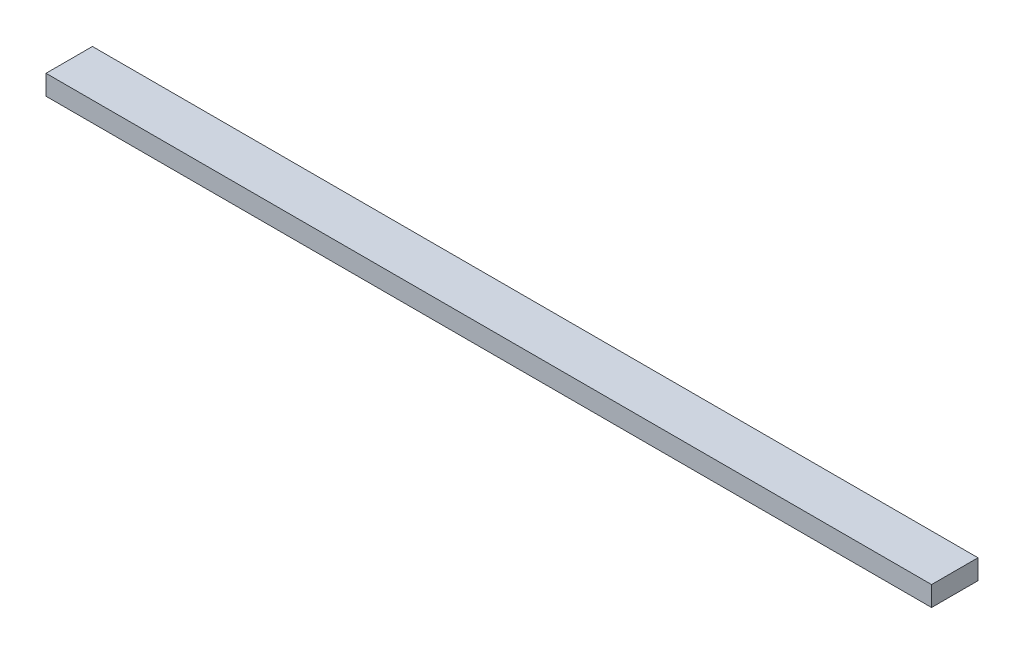
ISO-10303-21;
HEADER;
FILE_DESCRIPTION(('STEP AP214'),'2;1');
FILE_NAME('part.step','',(''),(''),'','','');
FILE_SCHEMA(('AUTOMOTIVE_DESIGN { 1 0 10303 214 1 1 1 1 }'));
ENDSEC;
DATA;
#1=APPLICATION_CONTEXT('core data for automotive mechanical design processes');
#2=APPLICATION_PROTOCOL_DEFINITION('international standard','automotive_design',2000,#1);
#3=PRODUCT_CONTEXT('',#1,'mechanical');
#4=PRODUCT('Part','Part','',(#3));
#5=PRODUCT_RELATED_PRODUCT_CATEGORY('part','',(#4));
#6=PRODUCT_DEFINITION_FORMATION('','',#4);
#7=PRODUCT_DEFINITION_CONTEXT('part definition',#1,'design');
#8=PRODUCT_DEFINITION('design','',#6,#7);
#9=PRODUCT_DEFINITION_SHAPE('','',#8);
#10=(LENGTH_UNIT() NAMED_UNIT(*) SI_UNIT(.MILLI.,.METRE.));
#11=(NAMED_UNIT(*) PLANE_ANGLE_UNIT() SI_UNIT($,.RADIAN.));
#12=(NAMED_UNIT(*) SI_UNIT($,.STERADIAN.) SOLID_ANGLE_UNIT());
#13=UNCERTAINTY_MEASURE_WITH_UNIT(LENGTH_MEASURE(1.E-05),#10,'distance_accuracy_value','');
#14=(GEOMETRIC_REPRESENTATION_CONTEXT(3) GLOBAL_UNCERTAINTY_ASSIGNED_CONTEXT((#13)) GLOBAL_UNIT_ASSIGNED_CONTEXT((#10,
#11,#12)) REPRESENTATION_CONTEXT('',''));
#15=CARTESIAN_POINT('',(0.,0.,0.));
#16=DIRECTION('',(0.,0.,1.));
#17=DIRECTION('',(1.,0.,0.));
#18=AXIS2_PLACEMENT_3D('',#15,#16,#17);
#19=CARTESIAN_POINT('',(0.,38.1,0.));
#20=DIRECTION('',(1.,0.,0.));
#21=DIRECTION('',(0.,0.,-1.));
#22=AXIS2_PLACEMENT_3D('',#19,#20,#21);
#23=PLANE('',#22);
#24=DIRECTION('',(0.,0.,1.));
#25=VECTOR('',#24,1.);
#26=CARTESIAN_POINT('',(0.,0.,0.));
#27=LINE('',#26,#25);
#28=CARTESIAN_POINT('',(0.,0.,-88.9));
#29=VERTEX_POINT('',#28);
#30=CARTESIAN_POINT('',(0.,0.,0.));
#31=VERTEX_POINT('',#30);
#32=EDGE_CURVE('E111',#29,#31,#27,.T.);
#33=ORIENTED_EDGE('',*,*,#32,.T.);
#34=DIRECTION('',(0.,-1.,0.));
#35=VECTOR('',#34,1.);
#36=CARTESIAN_POINT('',(0.,38.1,0.));
#37=LINE('',#36,#35);
#38=CARTESIAN_POINT('',(0.,38.1,0.));
#39=VERTEX_POINT('',#38);
#40=EDGE_CURVE('E11',#39,#31,#37,.T.);
#41=ORIENTED_EDGE('',*,*,#40,.F.);
#42=DIRECTION('',(0.,0.,1.));
#43=VECTOR('',#42,1.);
#44=CARTESIAN_POINT('',(0.,38.1,0.));
#45=LINE('',#44,#43);
#46=CARTESIAN_POINT('',(0.,38.1,-88.9));
#47=VERTEX_POINT('',#46);
#48=EDGE_CURVE('E94',#47,#39,#45,.T.);
#49=ORIENTED_EDGE('',*,*,#48,.F.);
#50=DIRECTION('',(0.,-1.,0.));
#51=VECTOR('',#50,1.);
#52=CARTESIAN_POINT('',(0.,38.1,-88.9));
#53=LINE('',#52,#51);
#54=EDGE_CURVE('E107',#47,#29,#53,.T.);
#55=ORIENTED_EDGE('',*,*,#54,.T.);
#56=EDGE_LOOP('',(#33,#41,#49,#55));
#57=FACE_BOUND('',#56,.T.);
#58=ADVANCED_FACE('F42',(#57),#23,.F.);
#59=CARTESIAN_POINT('',(0.,38.1,0.));
#60=DIRECTION('',(0.,0.,-1.));
#61=DIRECTION('',(-1.,0.,0.));
#62=AXIS2_PLACEMENT_3D('',#59,#60,#61);
#63=PLANE('',#62);
#64=DIRECTION('',(1.,0.,0.));
#65=VECTOR('',#64,1.);
#66=CARTESIAN_POINT('',(0.,0.,0.));
#67=LINE('',#66,#65);
#68=CARTESIAN_POINT('',(1695.45,0.,0.));
#69=VERTEX_POINT('',#68);
#70=EDGE_CURVE('E99',#31,#69,#67,.T.);
#71=ORIENTED_EDGE('',*,*,#70,.T.);
#72=DIRECTION('',(0.,-1.,0.));
#73=VECTOR('',#72,1.);
#74=CARTESIAN_POINT('',(1695.45,38.1,0.));
#75=LINE('',#74,#73);
#76=CARTESIAN_POINT('',(1695.45,38.1,0.));
#77=VERTEX_POINT('',#76);
#78=EDGE_CURVE('E51',#77,#69,#75,.T.);
#79=ORIENTED_EDGE('',*,*,#78,.F.);
#80=DIRECTION('',(1.,0.,0.));
#81=VECTOR('',#80,1.);
#82=CARTESIAN_POINT('',(0.,38.1,0.));
#83=LINE('',#82,#81);
#84=EDGE_CURVE('E89',#39,#77,#83,.T.);
#85=ORIENTED_EDGE('',*,*,#84,.F.);
#86=ORIENTED_EDGE('',*,*,#40,.T.);
#87=EDGE_LOOP('',(#71,#79,#85,#86));
#88=FACE_BOUND('',#87,.T.);
#89=ADVANCED_FACE('F98',(#88),#63,.F.);
#90=CARTESIAN_POINT('',(1695.45,38.1,0.));
#91=DIRECTION('',(-1.,0.,0.));
#92=DIRECTION('',(0.,0.,1.));
#93=AXIS2_PLACEMENT_3D('',#90,#91,#92);
#94=PLANE('',#93);
#95=DIRECTION('',(0.,0.,-1.));
#96=VECTOR('',#95,1.);
#97=CARTESIAN_POINT('',(1695.45,0.,0.));
#98=LINE('',#97,#96);
#99=CARTESIAN_POINT('',(1695.45,0.,-88.9));
#100=VERTEX_POINT('',#99);
#101=EDGE_CURVE('E76',#69,#100,#98,.T.);
#102=ORIENTED_EDGE('',*,*,#101,.T.);
#103=DIRECTION('',(0.,-1.,0.));
#104=VECTOR('',#103,1.);
#105=CARTESIAN_POINT('',(1695.45,38.1,-88.9));
#106=LINE('',#105,#104);
#107=CARTESIAN_POINT('',(1695.45,38.1,-88.9));
#108=VERTEX_POINT('',#107);
#109=EDGE_CURVE('E101',#108,#100,#106,.T.);
#110=ORIENTED_EDGE('',*,*,#109,.F.);
#111=DIRECTION('',(0.,0.,-1.));
#112=VECTOR('',#111,1.);
#113=CARTESIAN_POINT('',(1695.45,38.1,0.));
#114=LINE('',#113,#112);
#115=EDGE_CURVE('E92',#77,#108,#114,.T.);
#116=ORIENTED_EDGE('',*,*,#115,.F.);
#117=ORIENTED_EDGE('',*,*,#78,.T.);
#118=EDGE_LOOP('',(#102,#110,#116,#117));
#119=FACE_BOUND('',#118,.T.);
#120=ADVANCED_FACE('F102',(#119),#94,.F.);
#121=CARTESIAN_POINT('',(0.,38.1,-88.9));
#122=DIRECTION('',(0.,0.,1.));
#123=DIRECTION('',(1.,0.,0.));
#124=AXIS2_PLACEMENT_3D('',#121,#122,#123);
#125=PLANE('',#124);
#126=DIRECTION('',(-1.,0.,0.));
#127=VECTOR('',#126,1.);
#128=CARTESIAN_POINT('',(0.,0.,-88.9));
#129=LINE('',#128,#127);
#130=EDGE_CURVE('E82',#100,#29,#129,.T.);
#131=ORIENTED_EDGE('',*,*,#130,.T.);
#132=ORIENTED_EDGE('',*,*,#54,.F.);
#133=DIRECTION('',(-1.,0.,0.));
#134=VECTOR('',#133,1.);
#135=CARTESIAN_POINT('',(0.,38.1,-88.9));
#136=LINE('',#135,#134);
#137=EDGE_CURVE('E59',#108,#47,#136,.T.);
#138=ORIENTED_EDGE('',*,*,#137,.F.);
#139=ORIENTED_EDGE('',*,*,#109,.T.);
#140=EDGE_LOOP('',(#131,#132,#138,#139));
#141=FACE_BOUND('',#140,.T.);
#142=ADVANCED_FACE('F125',(#141),#125,.F.);
#143=CARTESIAN_POINT('',(0.,38.1,0.));
#144=DIRECTION('',(0.,-1.,0.));
#145=DIRECTION('',(0.,0.,-1.));
#146=AXIS2_PLACEMENT_3D('',#143,#144,#145);
#147=PLANE('',#146);
#148=ORIENTED_EDGE('',*,*,#48,.T.);
#149=ORIENTED_EDGE('',*,*,#84,.T.);
#150=ORIENTED_EDGE('',*,*,#115,.T.);
#151=ORIENTED_EDGE('',*,*,#137,.T.);
#152=EDGE_LOOP('',(#148,#149,#150,#151));
#153=FACE_BOUND('',#152,.T.);
#154=ADVANCED_FACE('F90',(#153),#147,.F.);
#155=CARTESIAN_POINT('',(0.,0.,0.));
#156=DIRECTION('',(0.,-1.,0.));
#157=DIRECTION('',(0.,0.,-1.));
#158=AXIS2_PLACEMENT_3D('',#155,#156,#157);
#159=PLANE('',#158);
#160=ORIENTED_EDGE('',*,*,#32,.F.);
#161=ORIENTED_EDGE('',*,*,#130,.F.);
#162=ORIENTED_EDGE('',*,*,#101,.F.);
#163=ORIENTED_EDGE('',*,*,#70,.F.);
#164=EDGE_LOOP('',(#160,#161,#162,#163));
#165=FACE_BOUND('',#164,.T.);
#166=ADVANCED_FACE('F128',(#165),#159,.T.);
#167=CLOSED_SHELL('',(#58,#89,#120,#142,#154,#166));
#168=MANIFOLD_SOLID_BREP('B2',#167);
#169=ADVANCED_BREP_SHAPE_REPRESENTATION('',(#18,#168),#14);
#170=SHAPE_DEFINITION_REPRESENTATION(#9,#169);
ENDSEC;
END-ISO-10303-21;
